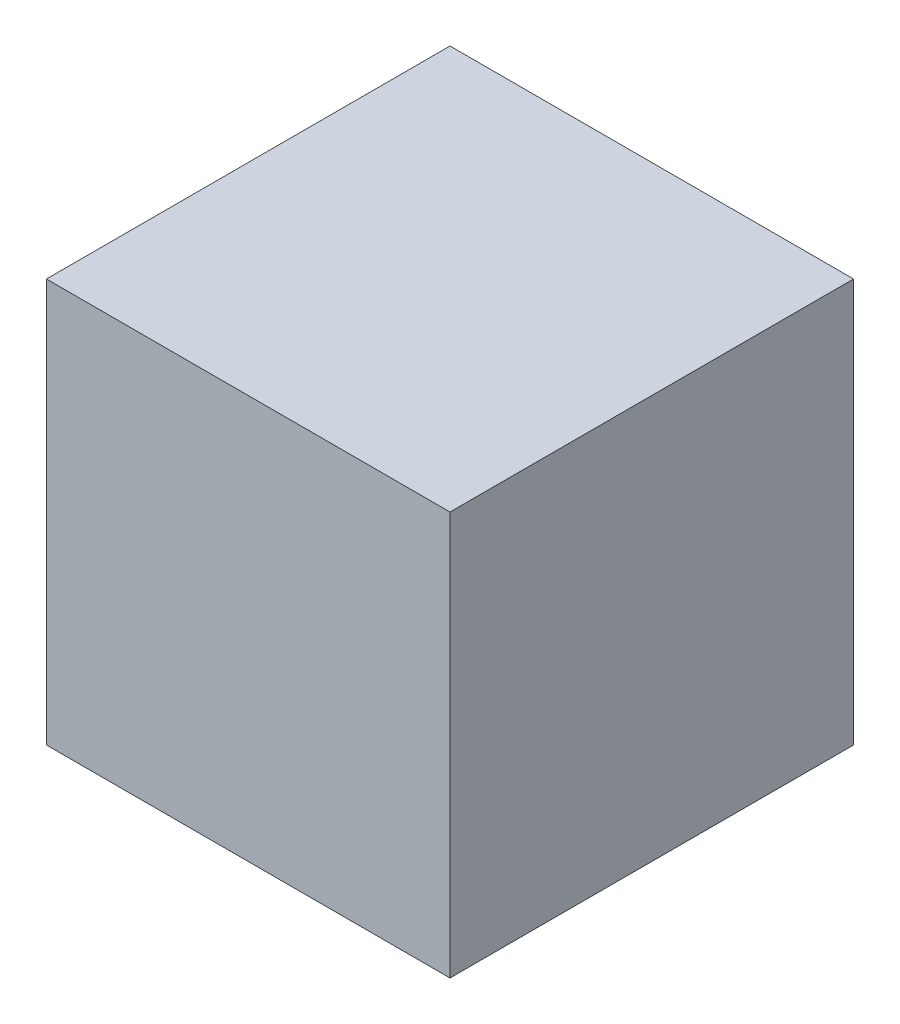
ISO-10303-21;
HEADER;
FILE_DESCRIPTION(('STEP AP214'),'2;1');
FILE_NAME('part.step','',(''),(''),'','','');
FILE_SCHEMA(('AUTOMOTIVE_DESIGN { 1 0 10303 214 1 1 1 1 }'));
ENDSEC;
DATA;
#1=APPLICATION_CONTEXT('core data for automotive mechanical design processes');
#2=APPLICATION_PROTOCOL_DEFINITION('international standard','automotive_design',2000,#1);
#3=PRODUCT_CONTEXT('',#1,'mechanical');
#4=PRODUCT('Part','Part','',(#3));
#5=PRODUCT_RELATED_PRODUCT_CATEGORY('part','',(#4));
#6=PRODUCT_DEFINITION_FORMATION('','',#4);
#7=PRODUCT_DEFINITION_CONTEXT('part definition',#1,'design');
#8=PRODUCT_DEFINITION('design','',#6,#7);
#9=PRODUCT_DEFINITION_SHAPE('','',#8);
#10=(LENGTH_UNIT() NAMED_UNIT(*) SI_UNIT(.MILLI.,.METRE.));
#11=(NAMED_UNIT(*) PLANE_ANGLE_UNIT() SI_UNIT($,.RADIAN.));
#12=(NAMED_UNIT(*) SI_UNIT($,.STERADIAN.) SOLID_ANGLE_UNIT());
#13=UNCERTAINTY_MEASURE_WITH_UNIT(LENGTH_MEASURE(1.E-05),#10,'distance_accuracy_value','');
#14=(GEOMETRIC_REPRESENTATION_CONTEXT(3) GLOBAL_UNCERTAINTY_ASSIGNED_CONTEXT((#13)) GLOBAL_UNIT_ASSIGNED_CONTEXT((#10,
#11,#12)) REPRESENTATION_CONTEXT('',''));
#15=CARTESIAN_POINT('',(0.,0.,0.));
#16=DIRECTION('',(0.,0.,1.));
#17=DIRECTION('',(1.,0.,0.));
#18=AXIS2_PLACEMENT_3D('',#15,#16,#17);
#19=CARTESIAN_POINT('',(28.829,57.658,-28.829));
#20=DIRECTION('',(-1.,0.,0.));
#21=DIRECTION('',(0.,0.,1.));
#22=AXIS2_PLACEMENT_3D('',#19,#20,#21);
#23=PLANE('',#22);
#24=DIRECTION('',(0.,0.,-1.));
#25=VECTOR('',#24,1.);
#26=CARTESIAN_POINT('',(28.829,0.,-28.829));
#27=LINE('',#26,#25);
#28=CARTESIAN_POINT('',(28.829,0.,28.829));
#29=VERTEX_POINT('',#28);
#30=CARTESIAN_POINT('',(28.829,0.,-28.829));
#31=VERTEX_POINT('',#30);
#32=EDGE_CURVE('E107',#29,#31,#27,.T.);
#33=ORIENTED_EDGE('',*,*,#32,.T.);
#34=DIRECTION('',(0.,-1.,0.));
#35=VECTOR('',#34,1.);
#36=CARTESIAN_POINT('',(28.829,57.658,-28.829));
#37=LINE('',#36,#35);
#38=CARTESIAN_POINT('',(28.829,57.658,-28.829));
#39=VERTEX_POINT('',#38);
#40=EDGE_CURVE('E11',#39,#31,#37,.T.);
#41=ORIENTED_EDGE('',*,*,#40,.F.);
#42=DIRECTION('',(0.,0.,-1.));
#43=VECTOR('',#42,1.);
#44=CARTESIAN_POINT('',(28.829,57.658,-28.829));
#45=LINE('',#44,#43);
#46=CARTESIAN_POINT('',(28.829,57.658,28.829));
#47=VERTEX_POINT('',#46);
#48=EDGE_CURVE('E91',#47,#39,#45,.T.);
#49=ORIENTED_EDGE('',*,*,#48,.F.);
#50=DIRECTION('',(0.,-1.,0.));
#51=VECTOR('',#50,1.);
#52=CARTESIAN_POINT('',(28.829,57.658,28.829));
#53=LINE('',#52,#51);
#54=EDGE_CURVE('E103',#47,#29,#53,.T.);
#55=ORIENTED_EDGE('',*,*,#54,.T.);
#56=EDGE_LOOP('',(#33,#41,#49,#55));
#57=FACE_BOUND('',#56,.T.);
#58=ADVANCED_FACE('F39',(#57),#23,.F.);
#59=CARTESIAN_POINT('',(-28.829,57.658,-28.829));
#60=DIRECTION('',(0.,0.,1.));
#61=DIRECTION('',(1.,0.,0.));
#62=AXIS2_PLACEMENT_3D('',#59,#60,#61);
#63=PLANE('',#62);
#64=DIRECTION('',(-1.,0.,0.));
#65=VECTOR('',#64,1.);
#66=CARTESIAN_POINT('',(-28.829,0.,-28.829));
#67=LINE('',#66,#65);
#68=CARTESIAN_POINT('',(-28.829,0.,-28.829));
#69=VERTEX_POINT('',#68);
#70=EDGE_CURVE('E96',#31,#69,#67,.T.);
#71=ORIENTED_EDGE('',*,*,#70,.T.);
#72=DIRECTION('',(0.,-1.,0.));
#73=VECTOR('',#72,1.);
#74=CARTESIAN_POINT('',(-28.829,57.658,-28.829));
#75=LINE('',#74,#73);
#76=CARTESIAN_POINT('',(-28.829,57.658,-28.829));
#77=VERTEX_POINT('',#76);
#78=EDGE_CURVE('E48',#77,#69,#75,.T.);
#79=ORIENTED_EDGE('',*,*,#78,.F.);
#80=DIRECTION('',(-1.,0.,0.));
#81=VECTOR('',#80,1.);
#82=CARTESIAN_POINT('',(-28.829,57.658,-28.829));
#83=LINE('',#82,#81);
#84=EDGE_CURVE('E86',#39,#77,#83,.T.);
#85=ORIENTED_EDGE('',*,*,#84,.F.);
#86=ORIENTED_EDGE('',*,*,#40,.T.);
#87=EDGE_LOOP('',(#71,#79,#85,#86));
#88=FACE_BOUND('',#87,.T.);
#89=ADVANCED_FACE('F95',(#88),#63,.F.);
#90=CARTESIAN_POINT('',(-28.829,57.658,-28.829));
#91=DIRECTION('',(1.,0.,0.));
#92=DIRECTION('',(0.,0.,-1.));
#93=AXIS2_PLACEMENT_3D('',#90,#91,#92);
#94=PLANE('',#93);
#95=DIRECTION('',(0.,0.,1.));
#96=VECTOR('',#95,1.);
#97=CARTESIAN_POINT('',(-28.829,0.,-28.829));
#98=LINE('',#97,#96);
#99=CARTESIAN_POINT('',(-28.829,0.,28.829));
#100=VERTEX_POINT('',#99);
#101=EDGE_CURVE('E73',#69,#100,#98,.T.);
#102=ORIENTED_EDGE('',*,*,#101,.T.);
#103=DIRECTION('',(0.,-1.,0.));
#104=VECTOR('',#103,1.);
#105=CARTESIAN_POINT('',(-28.829,57.658,28.829));
#106=LINE('',#105,#104);
#107=CARTESIAN_POINT('',(-28.829,57.658,28.829));
#108=VERTEX_POINT('',#107);
#109=EDGE_CURVE('E98',#108,#100,#106,.T.);
#110=ORIENTED_EDGE('',*,*,#109,.F.);
#111=DIRECTION('',(0.,0.,1.));
#112=VECTOR('',#111,1.);
#113=CARTESIAN_POINT('',(-28.829,57.658,-28.829));
#114=LINE('',#113,#112);
#115=EDGE_CURVE('E89',#77,#108,#114,.T.);
#116=ORIENTED_EDGE('',*,*,#115,.F.);
#117=ORIENTED_EDGE('',*,*,#78,.T.);
#118=EDGE_LOOP('',(#102,#110,#116,#117));
#119=FACE_BOUND('',#118,.T.);
#120=ADVANCED_FACE('F99',(#119),#94,.F.);
#121=CARTESIAN_POINT('',(-28.829,57.658,28.829));
#122=DIRECTION('',(0.,0.,-1.));
#123=DIRECTION('',(-1.,0.,0.));
#124=AXIS2_PLACEMENT_3D('',#121,#122,#123);
#125=PLANE('',#124);
#126=DIRECTION('',(1.,0.,0.));
#127=VECTOR('',#126,1.);
#128=CARTESIAN_POINT('',(-28.829,0.,28.829));
#129=LINE('',#128,#127);
#130=EDGE_CURVE('E79',#100,#29,#129,.T.);
#131=ORIENTED_EDGE('',*,*,#130,.T.);
#132=ORIENTED_EDGE('',*,*,#54,.F.);
#133=DIRECTION('',(1.,0.,0.));
#134=VECTOR('',#133,1.);
#135=CARTESIAN_POINT('',(-28.829,57.658,28.829));
#136=LINE('',#135,#134);
#137=EDGE_CURVE('E56',#108,#47,#136,.T.);
#138=ORIENTED_EDGE('',*,*,#137,.F.);
#139=ORIENTED_EDGE('',*,*,#109,.T.);
#140=EDGE_LOOP('',(#131,#132,#138,#139));
#141=FACE_BOUND('',#140,.T.);
#142=ADVANCED_FACE('F120',(#141),#125,.F.);
#143=CARTESIAN_POINT('',(0.,57.658,0.));
#144=DIRECTION('',(0.,1.,0.));
#145=DIRECTION('',(0.,0.,1.));
#146=AXIS2_PLACEMENT_3D('',#143,#144,#145);
#147=PLANE('',#146);
#148=ORIENTED_EDGE('',*,*,#48,.T.);
#149=ORIENTED_EDGE('',*,*,#84,.T.);
#150=ORIENTED_EDGE('',*,*,#115,.T.);
#151=ORIENTED_EDGE('',*,*,#137,.T.);
#152=EDGE_LOOP('',(#148,#149,#150,#151));
#153=FACE_BOUND('',#152,.T.);
#154=ADVANCED_FACE('F87',(#153),#147,.T.);
#155=CARTESIAN_POINT('',(0.,0.,0.));
#156=DIRECTION('',(0.,1.,0.));
#157=DIRECTION('',(0.,0.,1.));
#158=AXIS2_PLACEMENT_3D('',#155,#156,#157);
#159=PLANE('',#158);
#160=ORIENTED_EDGE('',*,*,#32,.F.);
#161=ORIENTED_EDGE('',*,*,#130,.F.);
#162=ORIENTED_EDGE('',*,*,#101,.F.);
#163=ORIENTED_EDGE('',*,*,#70,.F.);
#164=EDGE_LOOP('',(#160,#161,#162,#163));
#165=FACE_BOUND('',#164,.T.);
#166=ADVANCED_FACE('F123',(#165),#159,.F.);
#167=CLOSED_SHELL('',(#58,#89,#120,#142,#154,#166));
#168=MANIFOLD_SOLID_BREP('B2',#167);
#169=ADVANCED_BREP_SHAPE_REPRESENTATION('',(#18,#168),#14);
#170=SHAPE_DEFINITION_REPRESENTATION(#9,#169);
ENDSEC;
END-ISO-10303-21;
